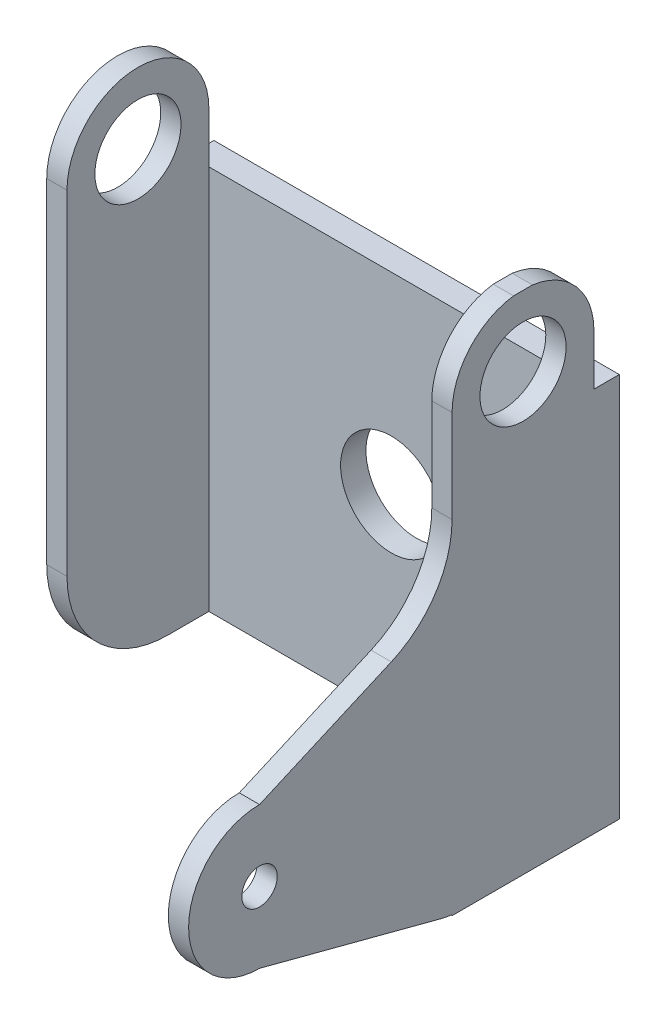
ISO-10303-21;
HEADER;
FILE_DESCRIPTION(('STEP AP214'),'2;1');
FILE_NAME('part.step','',(''),(''),'','','');
FILE_SCHEMA(('AUTOMOTIVE_DESIGN { 1 0 10303 214 1 1 1 1 }'));
ENDSEC;
DATA;
#1=APPLICATION_CONTEXT('core data for automotive mechanical design processes');
#2=APPLICATION_PROTOCOL_DEFINITION('international standard','automotive_design',2000,#1);
#3=PRODUCT_CONTEXT('',#1,'mechanical');
#4=PRODUCT('Part','Part','',(#3));
#5=PRODUCT_RELATED_PRODUCT_CATEGORY('part','',(#4));
#6=PRODUCT_DEFINITION_FORMATION('','',#4);
#7=PRODUCT_DEFINITION_CONTEXT('part definition',#1,'design');
#8=PRODUCT_DEFINITION('design','',#6,#7);
#9=PRODUCT_DEFINITION_SHAPE('','',#8);
#10=(LENGTH_UNIT() NAMED_UNIT(*) SI_UNIT(.MILLI.,.METRE.));
#11=(NAMED_UNIT(*) PLANE_ANGLE_UNIT() SI_UNIT($,.RADIAN.));
#12=(NAMED_UNIT(*) SI_UNIT($,.STERADIAN.) SOLID_ANGLE_UNIT());
#13=UNCERTAINTY_MEASURE_WITH_UNIT(LENGTH_MEASURE(1.E-05),#10,'distance_accuracy_value','');
#14=(GEOMETRIC_REPRESENTATION_CONTEXT(3) GLOBAL_UNCERTAINTY_ASSIGNED_CONTEXT((#13)) GLOBAL_UNIT_ASSIGNED_CONTEXT((#10,
#11,#12)) REPRESENTATION_CONTEXT('',''));
#15=CARTESIAN_POINT('',(0.,0.,0.));
#16=DIRECTION('',(0.,0.,1.));
#17=DIRECTION('',(1.,0.,0.));
#18=AXIS2_PLACEMENT_3D('',#15,#16,#17);
#19=CARTESIAN_POINT('',(20.,-19.,2.5));
#20=DIRECTION('',(-1.,0.,0.));
#21=DIRECTION('',(0.,0.,1.));
#22=AXIS2_PLACEMENT_3D('',#19,#20,#21);
#23=PLANE('',#22);
#24=CARTESIAN_POINT('',(20.,24.,9.5));
#25=DIRECTION('',(1.,0.,0.));
#26=DIRECTION('',(0.,0.,-1.));
#27=AXIS2_PLACEMENT_3D('',#24,#25,#26);
#28=CIRCLE('',#27,4.25);
#29=CARTESIAN_POINT('',(20.,24.,5.25));
#30=VERTEX_POINT('',#29);
#31=EDGE_CURVE('E522',#30,#30,#28,.T.);
#32=ORIENTED_EDGE('',*,*,#31,.F.);
#33=EDGE_LOOP('',(#32));
#34=FACE_BOUND('',#33,.T.);
#35=CARTESIAN_POINT('',(20.,-7.00000000000001,35.5));
#36=DIRECTION('',(1.,0.,0.));
#37=DIRECTION('',(0.,0.,-1.));
#38=AXIS2_PLACEMENT_3D('',#35,#36,#37);
#39=CIRCLE('',#38,1.75);
#40=CARTESIAN_POINT('',(20.,-7.00000000000001,33.75));
#41=VERTEX_POINT('',#40);
#42=EDGE_CURVE('E528',#41,#41,#39,.T.);
#43=ORIENTED_EDGE('',*,*,#42,.F.);
#44=EDGE_LOOP('',(#43));
#45=FACE_BOUND('',#44,.T.);
#46=CARTESIAN_POINT('',(20.,24.,9.5));
#47=DIRECTION('',(1.,0.,0.));
#48=DIRECTION('',(0.,0.,-1.));
#49=AXIS2_PLACEMENT_3D('',#46,#47,#48);
#50=CIRCLE('',#49,7.);
#51=CARTESIAN_POINT('',(20.,24.,2.5));
#52=VERTEX_POINT('',#51);
#53=CARTESIAN_POINT('',(20.,30.9374608885954,8.56638529402736));
#54=VERTEX_POINT('',#53);
#55=EDGE_CURVE('E161',#52,#54,#50,.T.);
#56=ORIENTED_EDGE('',*,*,#55,.T.);
#57=DIRECTION('',(0.,0.,-1.));
#58=VECTOR('',#57,1.);
#59=CARTESIAN_POINT('',(20.,30.9374608885954,42.5));
#60=LINE('',#59,#58);
#61=CARTESIAN_POINT('',(20.,30.9374608885954,10.4336147059726));
#62=VERTEX_POINT('',#61);
#63=EDGE_CURVE('E375',#62,#54,#60,.T.);
#64=ORIENTED_EDGE('',*,*,#63,.F.);
#65=CARTESIAN_POINT('',(20.,24.,9.5));
#66=DIRECTION('',(1.,0.,0.));
#67=DIRECTION('',(0.,0.,-1.));
#68=AXIS2_PLACEMENT_3D('',#65,#66,#67);
#69=CIRCLE('',#68,7.);
#70=CARTESIAN_POINT('',(20.,24.,16.5));
#71=VERTEX_POINT('',#70);
#72=EDGE_CURVE('E294',#62,#71,#69,.T.);
#73=ORIENTED_EDGE('',*,*,#72,.T.);
#74=DIRECTION('',(0.,-1.,0.));
#75=VECTOR('',#74,1.);
#76=CARTESIAN_POINT('',(20.,0.,16.5));
#77=LINE('',#76,#75);
#78=CARTESIAN_POINT('',(20.,14.8521224388592,16.5));
#79=VERTEX_POINT('',#78);
#80=EDGE_CURVE('E346',#71,#79,#77,.T.);
#81=ORIENTED_EDGE('',*,*,#80,.T.);
#82=CARTESIAN_POINT('',(20.,14.8521224388592,26.5));
#83=DIRECTION('',(1.,0.,0.));
#84=DIRECTION('',(0.,0.,-1.));
#85=AXIS2_PLACEMENT_3D('',#82,#83,#84);
#86=CIRCLE('',#85,10.);
#87=CARTESIAN_POINT('',(20.,5.69041116417988,22.4921269332208));
#88=VERTEX_POINT('',#87);
#89=EDGE_CURVE('E344',#79,#88,#86,.F.);
#90=ORIENTED_EDGE('',*,*,#89,.T.);
#91=DIRECTION('',(0.,0.400787306677926,-0.916171127467928));
#92=VECTOR('',#91,1.);
#93=CARTESIAN_POINT('',(20.,13.0352364315052,5.70238151439217));
#94=LINE('',#93,#92);
#95=CARTESIAN_POINT('',(20.,0.,35.5));
#96=VERTEX_POINT('',#95);
#97=EDGE_CURVE('E292',#96,#88,#94,.T.);
#98=ORIENTED_EDGE('',*,*,#97,.F.);
#99=CARTESIAN_POINT('',(20.,-7.00000000000001,35.5));
#100=DIRECTION('',(1.,0.,0.));
#101=DIRECTION('',(0.,0.,-1.));
#102=AXIS2_PLACEMENT_3D('',#99,#100,#101);
#103=CIRCLE('',#102,7.);
#104=CARTESIAN_POINT('',(20.,-14.,35.5));
#105=VERTEX_POINT('',#104);
#106=EDGE_CURVE('E285',#96,#105,#103,.T.);
#107=ORIENTED_EDGE('',*,*,#106,.T.);
#108=DIRECTION('',(0.,-0.254493299279644,-0.967074537262646));
#109=VECTOR('',#108,1.);
#110=CARTESIAN_POINT('',(20.,-21.830310880829,5.74481865284974));
#111=LINE('',#110,#109);
#112=CARTESIAN_POINT('',(20.,-18.6707453726265,17.7511675840195));
#113=VERTEX_POINT('',#112);
#114=EDGE_CURVE('E289',#105,#113,#111,.T.);
#115=ORIENTED_EDGE('',*,*,#114,.T.);
#116=CARTESIAN_POINT('',(20.,-9.,15.206234591223));
#117=DIRECTION('',(1.,0.,0.));
#118=DIRECTION('',(0.,0.,-1.));
#119=AXIS2_PLACEMENT_3D('',#116,#117,#118);
#120=CIRCLE('',#119,10.);
#121=CARTESIAN_POINT('',(20.,-18.9159553784319,16.5));
#122=VERTEX_POINT('',#121);
#123=EDGE_CURVE('E309',#122,#113,#120,.F.);
#124=ORIENTED_EDGE('',*,*,#123,.F.);
#125=DIRECTION('',(0.,-1.,0.));
#126=VECTOR('',#125,1.);
#127=CARTESIAN_POINT('',(20.,0.,16.5));
#128=LINE('',#127,#126);
#129=CARTESIAN_POINT('',(20.,-19.,16.5));
#130=VERTEX_POINT('',#129);
#131=EDGE_CURVE('E312',#122,#130,#128,.T.);
#132=ORIENTED_EDGE('',*,*,#131,.T.);
#133=DIRECTION('',(0.,0.,-1.));
#134=VECTOR('',#133,1.);
#135=CARTESIAN_POINT('',(20.,-19.,2.5));
#136=LINE('',#135,#134);
#137=CARTESIAN_POINT('',(20.,-19.,0.));
#138=VERTEX_POINT('',#137);
#139=EDGE_CURVE('E428',#130,#138,#136,.T.);
#140=ORIENTED_EDGE('',*,*,#139,.T.);
#141=DIRECTION('',(0.,1.,0.));
#142=VECTOR('',#141,1.);
#143=CARTESIAN_POINT('',(20.,-19.,0.));
#144=LINE('',#143,#142);
#145=CARTESIAN_POINT('',(20.,19.,0.));
#146=VERTEX_POINT('',#145);
#147=EDGE_CURVE('E418',#138,#146,#144,.T.);
#148=ORIENTED_EDGE('',*,*,#147,.T.);
#149=DIRECTION('',(0.,0.,-1.));
#150=VECTOR('',#149,1.);
#151=CARTESIAN_POINT('',(20.,19.,2.5));
#152=LINE('',#151,#150);
#153=CARTESIAN_POINT('',(20.,19.,2.5));
#154=VERTEX_POINT('',#153);
#155=EDGE_CURVE('E148',#154,#146,#152,.T.);
#156=ORIENTED_EDGE('',*,*,#155,.F.);
#157=DIRECTION('',(0.,-1.,0.));
#158=VECTOR('',#157,1.);
#159=CARTESIAN_POINT('',(20.,0.,2.5));
#160=LINE('',#159,#158);
#161=EDGE_CURVE('E366',#52,#154,#160,.T.);
#162=ORIENTED_EDGE('',*,*,#161,.F.);
#163=EDGE_LOOP('',(#56,#64,#73,#81,#90,#98,#107,#115,#124,#132,#140,#148,#156,#162));
#164=FACE_BOUND('',#163,.T.);
#165=ADVANCED_FACE('F145',(#34,#45,#164),#23,.F.);
#166=CARTESIAN_POINT('',(0.,30.9374608885954,42.5));
#167=DIRECTION('',(0.,1.,0.));
#168=DIRECTION('',(0.,0.,1.));
#169=AXIS2_PLACEMENT_3D('',#166,#167,#168);
#170=PLANE('',#169);
#171=ORIENTED_EDGE('',*,*,#63,.T.);
#172=DIRECTION('',(1.,0.,0.));
#173=VECTOR('',#172,1.);
#174=CARTESIAN_POINT('',(-20.001,30.9374608885954,8.56638529402736));
#175=LINE('',#174,#173);
#176=CARTESIAN_POINT('',(18.,30.9374608885954,8.56638529402736));
#177=VERTEX_POINT('',#176);
#178=EDGE_CURVE('E330',#177,#54,#175,.T.);
#179=ORIENTED_EDGE('',*,*,#178,.F.);
#180=DIRECTION('',(0.,0.,-1.));
#181=VECTOR('',#180,1.);
#182=CARTESIAN_POINT('',(18.,30.9374608885954,42.5));
#183=LINE('',#182,#181);
#184=CARTESIAN_POINT('',(18.,30.9374608885954,10.4336147059726));
#185=VERTEX_POINT('',#184);
#186=EDGE_CURVE('E372',#185,#177,#183,.T.);
#187=ORIENTED_EDGE('',*,*,#186,.F.);
#188=DIRECTION('',(1.,0.,0.));
#189=VECTOR('',#188,1.);
#190=CARTESIAN_POINT('',(-20.001,30.9374608885954,10.4336147059726));
#191=LINE('',#190,#189);
#192=EDGE_CURVE('E358',#185,#62,#191,.T.);
#193=ORIENTED_EDGE('',*,*,#192,.T.);
#194=EDGE_LOOP('',(#171,#179,#187,#193));
#195=FACE_BOUND('',#194,.T.);
#196=ADVANCED_FACE('F501',(#195),#170,.T.);
#197=CARTESIAN_POINT('',(18.,0.,42.5));
#198=DIRECTION('',(-1.,0.,0.));
#199=DIRECTION('',(0.,0.,1.));
#200=AXIS2_PLACEMENT_3D('',#197,#198,#199);
#201=PLANE('',#200);
#202=CARTESIAN_POINT('',(18.,24.,9.5));
#203=DIRECTION('',(-1.,0.,0.));
#204=DIRECTION('',(0.,0.,1.));
#205=AXIS2_PLACEMENT_3D('',#202,#203,#204);
#206=CIRCLE('',#205,4.25);
#207=CARTESIAN_POINT('',(18.,24.,13.75));
#208=VERTEX_POINT('',#207);
#209=EDGE_CURVE('E525',#208,#208,#206,.F.);
#210=ORIENTED_EDGE('',*,*,#209,.T.);
#211=EDGE_LOOP('',(#210));
#212=FACE_BOUND('',#211,.T.);
#213=CARTESIAN_POINT('',(18.,-7.00000000000001,35.5));
#214=DIRECTION('',(-1.,0.,0.));
#215=DIRECTION('',(0.,0.,1.));
#216=AXIS2_PLACEMENT_3D('',#213,#214,#215);
#217=CIRCLE('',#216,1.75);
#218=CARTESIAN_POINT('',(18.,-7.00000000000001,37.25));
#219=VERTEX_POINT('',#218);
#220=EDGE_CURVE('E332',#219,#219,#217,.F.);
#221=ORIENTED_EDGE('',*,*,#220,.T.);
#222=EDGE_LOOP('',(#221));
#223=FACE_BOUND('',#222,.T.);
#224=ORIENTED_EDGE('',*,*,#186,.T.);
#225=CARTESIAN_POINT('',(18.,24.,9.5));
#226=DIRECTION('',(-1.,0.,0.));
#227=DIRECTION('',(0.,0.,1.));
#228=AXIS2_PLACEMENT_3D('',#225,#226,#227);
#229=CIRCLE('',#228,7.);
#230=CARTESIAN_POINT('',(18.,24.,2.5));
#231=VERTEX_POINT('',#230);
#232=EDGE_CURVE('E304',#231,#177,#229,.F.);
#233=ORIENTED_EDGE('',*,*,#232,.F.);
#234=DIRECTION('',(0.,1.,0.));
#235=VECTOR('',#234,1.);
#236=CARTESIAN_POINT('',(18.,0.,2.5));
#237=LINE('',#236,#235);
#238=CARTESIAN_POINT('',(18.,19.,2.5));
#239=VERTEX_POINT('',#238);
#240=EDGE_CURVE('E368',#239,#231,#237,.T.);
#241=ORIENTED_EDGE('',*,*,#240,.F.);
#242=CARTESIAN_POINT('',(18.,-19.,2.5));
#243=VERTEX_POINT('',#242);
#244=EDGE_CURVE('E169',#243,#239,#237,.T.);
#245=ORIENTED_EDGE('',*,*,#244,.F.);
#246=DIRECTION('',(0.,0.,-1.));
#247=VECTOR('',#246,1.);
#248=CARTESIAN_POINT('',(18.,-19.,42.5));
#249=LINE('',#248,#247);
#250=CARTESIAN_POINT('',(18.,-19.,16.5));
#251=VERTEX_POINT('',#250);
#252=EDGE_CURVE('E370',#251,#243,#249,.T.);
#253=ORIENTED_EDGE('',*,*,#252,.F.);
#254=DIRECTION('',(0.,-1.,0.));
#255=VECTOR('',#254,1.);
#256=CARTESIAN_POINT('',(18.,0.,16.5));
#257=LINE('',#256,#255);
#258=CARTESIAN_POINT('',(18.,-18.9159553784319,16.5));
#259=VERTEX_POINT('',#258);
#260=EDGE_CURVE('E325',#259,#251,#257,.T.);
#261=ORIENTED_EDGE('',*,*,#260,.F.);
#262=CARTESIAN_POINT('',(18.,-9.,15.206234591223));
#263=DIRECTION('',(-1.,0.,0.));
#264=DIRECTION('',(0.,0.,1.));
#265=AXIS2_PLACEMENT_3D('',#262,#263,#264);
#266=CIRCLE('',#265,10.);
#267=CARTESIAN_POINT('',(18.,-18.6707453726265,17.7511675840195));
#268=VERTEX_POINT('',#267);
#269=EDGE_CURVE('E322',#259,#268,#266,.T.);
#270=ORIENTED_EDGE('',*,*,#269,.T.);
#271=DIRECTION('',(0.,-0.254493299279644,-0.967074537262646));
#272=VECTOR('',#271,1.);
#273=CARTESIAN_POINT('',(18.,-21.830310880829,5.74481865284974));
#274=LINE('',#273,#272);
#275=CARTESIAN_POINT('',(18.,-14.,35.5));
#276=VERTEX_POINT('',#275);
#277=EDGE_CURVE('E320',#276,#268,#274,.T.);
#278=ORIENTED_EDGE('',*,*,#277,.F.);
#279=CARTESIAN_POINT('',(18.,-7.00000000000001,35.5));
#280=DIRECTION('',(-1.,0.,0.));
#281=DIRECTION('',(0.,0.,1.));
#282=AXIS2_PLACEMENT_3D('',#279,#280,#281);
#283=CIRCLE('',#282,7.);
#284=CARTESIAN_POINT('',(18.,0.,35.5));
#285=VERTEX_POINT('',#284);
#286=EDGE_CURVE('E300',#285,#276,#283,.F.);
#287=ORIENTED_EDGE('',*,*,#286,.F.);
#288=DIRECTION('',(0.,0.400787306677926,-0.916171127467928));
#289=VECTOR('',#288,1.);
#290=CARTESIAN_POINT('',(18.,13.0352364315052,5.70238151439217));
#291=LINE('',#290,#289);
#292=CARTESIAN_POINT('',(18.,5.69041116417988,22.4921269332208));
#293=VERTEX_POINT('',#292);
#294=EDGE_CURVE('E340',#285,#293,#291,.T.);
#295=ORIENTED_EDGE('',*,*,#294,.T.);
#296=CARTESIAN_POINT('',(18.,14.8521224388592,26.5));
#297=DIRECTION('',(-1.,0.,0.));
#298=DIRECTION('',(0.,0.,1.));
#299=AXIS2_PLACEMENT_3D('',#296,#297,#298);
#300=CIRCLE('',#299,10.);
#301=CARTESIAN_POINT('',(18.,14.8521224388592,16.5));
#302=VERTEX_POINT('',#301);
#303=EDGE_CURVE('E337',#302,#293,#300,.T.);
#304=ORIENTED_EDGE('',*,*,#303,.F.);
#305=DIRECTION('',(0.,-1.,0.));
#306=VECTOR('',#305,1.);
#307=CARTESIAN_POINT('',(18.,0.,16.5));
#308=LINE('',#307,#306);
#309=CARTESIAN_POINT('',(18.,24.,16.5));
#310=VERTEX_POINT('',#309);
#311=EDGE_CURVE('E355',#310,#302,#308,.T.);
#312=ORIENTED_EDGE('',*,*,#311,.F.);
#313=CARTESIAN_POINT('',(18.,24.,9.5));
#314=DIRECTION('',(-1.,0.,0.));
#315=DIRECTION('',(0.,0.,1.));
#316=AXIS2_PLACEMENT_3D('',#313,#314,#315);
#317=CIRCLE('',#316,7.);
#318=EDGE_CURVE('E327',#185,#310,#317,.F.);
#319=ORIENTED_EDGE('',*,*,#318,.F.);
#320=EDGE_LOOP('',(#224,#233,#241,#245,#253,#261,#270,#278,#287,#295,#304,#312,#319));
#321=FACE_BOUND('',#320,.T.);
#322=ADVANCED_FACE('F494',(#212,#223,#321),#201,.T.);
#323=CARTESIAN_POINT('',(-20.,-19.,2.5));
#324=DIRECTION('',(0.,1.,0.));
#325=DIRECTION('',(0.,0.,1.));
#326=AXIS2_PLACEMENT_3D('',#323,#324,#325);
#327=PLANE('',#326);
#328=DIRECTION('',(1.,0.,0.));
#329=VECTOR('',#328,1.);
#330=CARTESIAN_POINT('',(-20.001,-19.,16.5));
#331=LINE('',#330,#329);
#332=EDGE_CURVE('E310',#251,#130,#331,.T.);
#333=ORIENTED_EDGE('',*,*,#332,.F.);
#334=ORIENTED_EDGE('',*,*,#252,.T.);
#335=DIRECTION('',(1.,0.,0.));
#336=VECTOR('',#335,1.);
#337=CARTESIAN_POINT('',(-20.,-19.,2.5));
#338=LINE('',#337,#336);
#339=CARTESIAN_POINT('',(-18.,-19.,2.5));
#340=VERTEX_POINT('',#339);
#341=EDGE_CURVE('E424',#340,#243,#338,.T.);
#342=ORIENTED_EDGE('',*,*,#341,.F.);
#343=DIRECTION('',(0.,0.,-1.));
#344=VECTOR('',#343,1.);
#345=CARTESIAN_POINT('',(-18.,-19.,16.5));
#346=LINE('',#345,#344);
#347=CARTESIAN_POINT('',(-18.,-19.,6.49999999999993));
#348=VERTEX_POINT('',#347);
#349=EDGE_CURVE('E410',#348,#340,#346,.T.);
#350=ORIENTED_EDGE('',*,*,#349,.F.);
#351=DIRECTION('',(1.,0.,0.));
#352=VECTOR('',#351,1.);
#353=CARTESIAN_POINT('',(-20.,-19.,6.49999999999993));
#354=LINE('',#353,#352);
#355=CARTESIAN_POINT('',(-20.,-19.,6.49999999999993));
#356=VERTEX_POINT('',#355);
#357=EDGE_CURVE('E391',#356,#348,#354,.T.);
#358=ORIENTED_EDGE('',*,*,#357,.F.);
#359=DIRECTION('',(0.,0.,-1.));
#360=VECTOR('',#359,1.);
#361=CARTESIAN_POINT('',(-20.,-19.,2.5));
#362=LINE('',#361,#360);
#363=CARTESIAN_POINT('',(-20.,-19.,0.));
#364=VERTEX_POINT('',#363);
#365=EDGE_CURVE('E440',#356,#364,#362,.T.);
#366=ORIENTED_EDGE('',*,*,#365,.T.);
#367=DIRECTION('',(1.,0.,0.));
#368=VECTOR('',#367,1.);
#369=CARTESIAN_POINT('',(-20.,-19.,0.));
#370=LINE('',#369,#368);
#371=EDGE_CURVE('E436',#364,#138,#370,.T.);
#372=ORIENTED_EDGE('',*,*,#371,.T.);
#373=ORIENTED_EDGE('',*,*,#139,.F.);
#374=EDGE_LOOP('',(#333,#334,#342,#350,#358,#366,#372,#373));
#375=FACE_BOUND('',#374,.T.);
#376=ADVANCED_FACE('F464',(#375),#327,.F.);
#377=CARTESIAN_POINT('',(-20.,-19.,2.5));
#378=DIRECTION('',(1.,0.,0.));
#379=DIRECTION('',(0.,0.,-1.));
#380=AXIS2_PLACEMENT_3D('',#377,#378,#379);
#381=PLANE('',#380);
#382=CARTESIAN_POINT('',(-20.,24.,9.5));
#383=DIRECTION('',(1.,0.,0.));
#384=DIRECTION('',(0.,1.,0.));
#385=AXIS2_PLACEMENT_3D('',#382,#383,#384);
#386=CIRCLE('',#385,4.25);
#387=CARTESIAN_POINT('',(-20.,28.25,9.5));
#388=VERTEX_POINT('',#387);
#389=EDGE_CURVE('E381',#388,#388,#386,.T.);
#390=ORIENTED_EDGE('',*,*,#389,.T.);
#391=EDGE_LOOP('',(#390));
#392=FACE_BOUND('',#391,.T.);
#393=DIRECTION('',(0.,-1.,0.));
#394=VECTOR('',#393,1.);
#395=CARTESIAN_POINT('',(-20.,31.,16.5));
#396=LINE('',#395,#394);
#397=CARTESIAN_POINT('',(-20.,24.,16.5));
#398=VERTEX_POINT('',#397);
#399=CARTESIAN_POINT('',(-20.,-8.99999999999993,16.5));
#400=VERTEX_POINT('',#399);
#401=EDGE_CURVE('E408',#398,#400,#396,.T.);
#402=ORIENTED_EDGE('',*,*,#401,.F.);
#403=CARTESIAN_POINT('',(-20.,24.,9.5));
#404=DIRECTION('',(1.,0.,0.));
#405=DIRECTION('',(0.,1.,0.));
#406=AXIS2_PLACEMENT_3D('',#403,#404,#405);
#407=CIRCLE('',#406,7.);
#408=CARTESIAN_POINT('',(-20.,24.,2.5));
#409=VERTEX_POINT('',#408);
#410=EDGE_CURVE('E402',#409,#398,#407,.T.);
#411=ORIENTED_EDGE('',*,*,#410,.F.);
#412=DIRECTION('',(0.,-1.,0.));
#413=VECTOR('',#412,1.);
#414=CARTESIAN_POINT('',(-20.,19.,2.5));
#415=LINE('',#414,#413);
#416=CARTESIAN_POINT('',(-20.,19.,2.5));
#417=VERTEX_POINT('',#416);
#418=EDGE_CURVE('E398',#409,#417,#415,.T.);
#419=ORIENTED_EDGE('',*,*,#418,.T.);
#420=DIRECTION('',(0.,0.,-1.));
#421=VECTOR('',#420,1.);
#422=CARTESIAN_POINT('',(-20.,19.,2.5));
#423=LINE('',#422,#421);
#424=CARTESIAN_POINT('',(-20.,19.,0.));
#425=VERTEX_POINT('',#424);
#426=EDGE_CURVE('E441',#417,#425,#423,.T.);
#427=ORIENTED_EDGE('',*,*,#426,.T.);
#428=DIRECTION('',(0.,-1.,0.));
#429=VECTOR('',#428,1.);
#430=CARTESIAN_POINT('',(-20.,-19.,0.));
#431=LINE('',#430,#429);
#432=EDGE_CURVE('E433',#425,#364,#431,.T.);
#433=ORIENTED_EDGE('',*,*,#432,.T.);
#434=ORIENTED_EDGE('',*,*,#365,.F.);
#435=CARTESIAN_POINT('',(-20.,-9.,6.5));
#436=DIRECTION('',(1.,0.,0.));
#437=DIRECTION('',(0.,1.,0.));
#438=AXIS2_PLACEMENT_3D('',#435,#436,#437);
#439=CIRCLE('',#438,10.);
#440=EDGE_CURVE('E388',#356,#400,#439,.F.);
#441=ORIENTED_EDGE('',*,*,#440,.T.);
#442=EDGE_LOOP('',(#402,#411,#419,#427,#433,#434,#441));
#443=FACE_BOUND('',#442,.T.);
#444=ADVANCED_FACE('F460',(#392,#443),#381,.F.);
#445=CARTESIAN_POINT('',(-18.,19.,16.5));
#446=DIRECTION('',(1.,0.,0.));
#447=DIRECTION('',(0.,1.,0.));
#448=AXIS2_PLACEMENT_3D('',#445,#446,#447);
#449=PLANE('',#448);
#450=CARTESIAN_POINT('',(-18.,24.,9.5));
#451=DIRECTION('',(1.,0.,0.));
#452=DIRECTION('',(0.,1.,0.));
#453=AXIS2_PLACEMENT_3D('',#450,#451,#452);
#454=CIRCLE('',#453,4.25);
#455=CARTESIAN_POINT('',(-18.,28.25,9.5));
#456=VERTEX_POINT('',#455);
#457=EDGE_CURVE('E382',#456,#456,#454,.T.);
#458=ORIENTED_EDGE('',*,*,#457,.F.);
#459=EDGE_LOOP('',(#458));
#460=FACE_BOUND('',#459,.T.);
#461=CARTESIAN_POINT('',(-18.,24.,9.5));
#462=DIRECTION('',(1.,0.,0.));
#463=DIRECTION('',(0.,1.,0.));
#464=AXIS2_PLACEMENT_3D('',#461,#462,#463);
#465=CIRCLE('',#464,7.);
#466=CARTESIAN_POINT('',(-18.,24.,2.5));
#467=VERTEX_POINT('',#466);
#468=CARTESIAN_POINT('',(-18.,24.,16.5));
#469=VERTEX_POINT('',#468);
#470=EDGE_CURVE('E394',#467,#469,#465,.T.);
#471=ORIENTED_EDGE('',*,*,#470,.T.);
#472=DIRECTION('',(0.,1.,0.));
#473=VECTOR('',#472,1.);
#474=CARTESIAN_POINT('',(-18.,19.,16.5));
#475=LINE('',#474,#473);
#476=CARTESIAN_POINT('',(-18.,-8.99999999999993,16.5));
#477=VERTEX_POINT('',#476);
#478=EDGE_CURVE('E405',#477,#469,#475,.T.);
#479=ORIENTED_EDGE('',*,*,#478,.F.);
#480=CARTESIAN_POINT('',(-18.,-9.,6.5));
#481=DIRECTION('',(1.,0.,0.));
#482=DIRECTION('',(0.,1.,0.));
#483=AXIS2_PLACEMENT_3D('',#480,#481,#482);
#484=CIRCLE('',#483,10.);
#485=EDGE_CURVE('E392',#348,#477,#484,.F.);
#486=ORIENTED_EDGE('',*,*,#485,.F.);
#487=ORIENTED_EDGE('',*,*,#349,.T.);
#488=DIRECTION('',(0.,-1.,0.));
#489=VECTOR('',#488,1.);
#490=CARTESIAN_POINT('',(-18.,19.,2.5));
#491=LINE('',#490,#489);
#492=CARTESIAN_POINT('',(-18.,19.,2.5));
#493=VERTEX_POINT('',#492);
#494=EDGE_CURVE('E12',#493,#340,#491,.T.);
#495=ORIENTED_EDGE('',*,*,#494,.F.);
#496=EDGE_CURVE('E154',#467,#493,#491,.T.);
#497=ORIENTED_EDGE('',*,*,#496,.F.);
#498=EDGE_LOOP('',(#471,#479,#486,#487,#495,#497));
#499=FACE_BOUND('',#498,.T.);
#500=ADVANCED_FACE('F473',(#460,#499),#449,.T.);
#501=CARTESIAN_POINT('',(0.,0.,2.5));
#502=DIRECTION('',(0.,0.,-1.));
#503=DIRECTION('',(-1.,0.,0.));
#504=AXIS2_PLACEMENT_3D('',#501,#502,#503);
#505=PLANE('',#504);
#506=ORIENTED_EDGE('',*,*,#341,.T.);
#507=ORIENTED_EDGE('',*,*,#244,.T.);
#508=DIRECTION('',(-1.,0.,0.));
#509=VECTOR('',#508,1.);
#510=CARTESIAN_POINT('',(-20.,19.,2.5));
#511=LINE('',#510,#509);
#512=EDGE_CURVE('E425',#239,#493,#511,.T.);
#513=ORIENTED_EDGE('',*,*,#512,.T.);
#514=ORIENTED_EDGE('',*,*,#494,.T.);
#515=EDGE_LOOP('',(#506,#507,#513,#514));
#516=FACE_BOUND('',#515,.T.);
#517=CARTESIAN_POINT('',(0.,0.,2.5));
#518=DIRECTION('',(0.,0.,1.));
#519=DIRECTION('',(1.,0.,0.));
#520=AXIS2_PLACEMENT_3D('',#517,#518,#519);
#521=CIRCLE('',#520,5.);
#522=CARTESIAN_POINT('',(5.,0.,2.5));
#523=VERTEX_POINT('',#522);
#524=EDGE_CURVE('E415',#523,#523,#521,.T.);
#525=ORIENTED_EDGE('',*,*,#524,.F.);
#526=EDGE_LOOP('',(#525));
#527=FACE_BOUND('',#526,.T.);
#528=ADVANCED_FACE('F486',(#516,#527),#505,.F.);
#529=CARTESIAN_POINT('',(0.,0.,0.));
#530=DIRECTION('',(0.,0.,-1.));
#531=DIRECTION('',(-1.,0.,0.));
#532=AXIS2_PLACEMENT_3D('',#529,#530,#531);
#533=PLANE('',#532);
#534=ORIENTED_EDGE('',*,*,#147,.F.);
#535=ORIENTED_EDGE('',*,*,#371,.F.);
#536=ORIENTED_EDGE('',*,*,#432,.F.);
#537=DIRECTION('',(-1.,0.,0.));
#538=VECTOR('',#537,1.);
#539=CARTESIAN_POINT('',(-20.,19.,0.));
#540=LINE('',#539,#538);
#541=EDGE_CURVE('E431',#146,#425,#540,.T.);
#542=ORIENTED_EDGE('',*,*,#541,.F.);
#543=EDGE_LOOP('',(#534,#535,#536,#542));
#544=FACE_BOUND('',#543,.T.);
#545=CARTESIAN_POINT('',(0.,0.,0.));
#546=DIRECTION('',(0.,0.,1.));
#547=DIRECTION('',(1.,0.,0.));
#548=AXIS2_PLACEMENT_3D('',#545,#546,#547);
#549=CIRCLE('',#548,5.);
#550=CARTESIAN_POINT('',(5.,0.,0.));
#551=VERTEX_POINT('',#550);
#552=EDGE_CURVE('E414',#551,#551,#549,.T.);
#553=ORIENTED_EDGE('',*,*,#552,.T.);
#554=EDGE_LOOP('',(#553));
#555=FACE_BOUND('',#554,.T.);
#556=ADVANCED_FACE('F456',(#544,#555),#533,.T.);
#557=CARTESIAN_POINT('',(-20.,19.,2.5));
#558=DIRECTION('',(0.,-1.,0.));
#559=DIRECTION('',(0.,0.,-1.));
#560=AXIS2_PLACEMENT_3D('',#557,#558,#559);
#561=PLANE('',#560);
#562=ORIENTED_EDGE('',*,*,#541,.T.);
#563=ORIENTED_EDGE('',*,*,#426,.F.);
#564=EDGE_CURVE('E426',#493,#417,#511,.T.);
#565=ORIENTED_EDGE('',*,*,#564,.F.);
#566=ORIENTED_EDGE('',*,*,#512,.F.);
#567=EDGE_CURVE('E421',#154,#239,#511,.T.);
#568=ORIENTED_EDGE('',*,*,#567,.F.);
#569=ORIENTED_EDGE('',*,*,#155,.T.);
#570=EDGE_LOOP('',(#562,#563,#565,#566,#568,#569));
#571=FACE_BOUND('',#570,.T.);
#572=ADVANCED_FACE('F450',(#571),#561,.F.);
#573=CARTESIAN_POINT('',(0.,0.,2.5));
#574=DIRECTION('',(0.,0.,-1.));
#575=DIRECTION('',(-1.,0.,0.));
#576=AXIS2_PLACEMENT_3D('',#573,#574,#575);
#577=CYLINDRICAL_SURFACE('',#576,5.);
#578=ORIENTED_EDGE('',*,*,#524,.T.);
#579=EDGE_LOOP('',(#578));
#580=FACE_BOUND('',#579,.T.);
#581=ORIENTED_EDGE('',*,*,#552,.F.);
#582=EDGE_LOOP('',(#581));
#583=FACE_BOUND('',#582,.T.);
#584=ADVANCED_FACE('F595',(#580,#583),#577,.F.);
#585=CARTESIAN_POINT('',(0.,0.,2.5));
#586=DIRECTION('',(0.,0.,1.));
#587=DIRECTION('',(1.,0.,0.));
#588=AXIS2_PLACEMENT_3D('',#585,#586,#587);
#589=PLANE('',#588);
#590=ORIENTED_EDGE('',*,*,#418,.F.);
#591=DIRECTION('',(1.,0.,0.));
#592=VECTOR('',#591,1.);
#593=CARTESIAN_POINT('',(-20.,24.,2.5));
#594=LINE('',#593,#592);
#595=EDGE_CURVE('E385',#409,#467,#594,.T.);
#596=ORIENTED_EDGE('',*,*,#595,.T.);
#597=ORIENTED_EDGE('',*,*,#496,.T.);
#598=ORIENTED_EDGE('',*,*,#564,.T.);
#599=EDGE_LOOP('',(#590,#596,#597,#598));
#600=FACE_BOUND('',#599,.T.);
#601=ADVANCED_FACE('F484',(#600),#589,.F.);
#602=CARTESIAN_POINT('',(0.,0.,16.5));
#603=DIRECTION('',(0.,0.,1.));
#604=DIRECTION('',(1.,0.,0.));
#605=AXIS2_PLACEMENT_3D('',#602,#603,#604);
#606=PLANE('',#605);
#607=DIRECTION('',(1.,0.,0.));
#608=VECTOR('',#607,1.);
#609=CARTESIAN_POINT('',(-20.,24.,16.5));
#610=LINE('',#609,#608);
#611=EDGE_CURVE('E378',#398,#469,#610,.T.);
#612=ORIENTED_EDGE('',*,*,#611,.F.);
#613=ORIENTED_EDGE('',*,*,#401,.T.);
#614=DIRECTION('',(1.,0.,0.));
#615=VECTOR('',#614,1.);
#616=CARTESIAN_POINT('',(-20.,-8.99999999999993,16.5));
#617=LINE('',#616,#615);
#618=EDGE_CURVE('E395',#400,#477,#617,.T.);
#619=ORIENTED_EDGE('',*,*,#618,.T.);
#620=ORIENTED_EDGE('',*,*,#478,.T.);
#621=EDGE_LOOP('',(#612,#613,#619,#620));
#622=FACE_BOUND('',#621,.T.);
#623=ADVANCED_FACE('F478',(#622),#606,.T.);
#624=CARTESIAN_POINT('',(-20.,-9.,6.5));
#625=DIRECTION('',(1.,0.,0.));
#626=DIRECTION('',(0.,1.,0.));
#627=AXIS2_PLACEMENT_3D('',#624,#625,#626);
#628=CYLINDRICAL_SURFACE('',#627,10.);
#629=ORIENTED_EDGE('',*,*,#485,.T.);
#630=ORIENTED_EDGE('',*,*,#618,.F.);
#631=ORIENTED_EDGE('',*,*,#440,.F.);
#632=ORIENTED_EDGE('',*,*,#357,.T.);
#633=EDGE_LOOP('',(#629,#630,#631,#632));
#634=FACE_BOUND('',#633,.T.);
#635=ADVANCED_FACE('F469',(#634),#628,.T.);
#636=CARTESIAN_POINT('',(-20.,24.,9.5));
#637=DIRECTION('',(1.,0.,0.));
#638=DIRECTION('',(0.,1.,0.));
#639=AXIS2_PLACEMENT_3D('',#636,#637,#638);
#640=CYLINDRICAL_SURFACE('',#639,7.);
#641=ORIENTED_EDGE('',*,*,#470,.F.);
#642=ORIENTED_EDGE('',*,*,#595,.F.);
#643=ORIENTED_EDGE('',*,*,#410,.T.);
#644=ORIENTED_EDGE('',*,*,#611,.T.);
#645=EDGE_LOOP('',(#641,#642,#643,#644));
#646=FACE_BOUND('',#645,.T.);
#647=ADVANCED_FACE('F585',(#646),#640,.T.);
#648=CARTESIAN_POINT('',(-20.,24.,9.5));
#649=DIRECTION('',(1.,0.,0.));
#650=DIRECTION('',(0.,1.,0.));
#651=AXIS2_PLACEMENT_3D('',#648,#649,#650);
#652=CYLINDRICAL_SURFACE('',#651,4.25);
#653=ORIENTED_EDGE('',*,*,#389,.F.);
#654=EDGE_LOOP('',(#653));
#655=FACE_BOUND('',#654,.T.);
#656=ORIENTED_EDGE('',*,*,#457,.T.);
#657=EDGE_LOOP('',(#656));
#658=FACE_BOUND('',#657,.T.);
#659=ADVANCED_FACE('F579',(#655,#658),#652,.F.);
#660=CARTESIAN_POINT('',(0.,0.,2.5));
#661=DIRECTION('',(0.,0.,1.));
#662=DIRECTION('',(1.,0.,0.));
#663=AXIS2_PLACEMENT_3D('',#660,#661,#662);
#664=PLANE('',#663);
#665=ORIENTED_EDGE('',*,*,#240,.T.);
#666=DIRECTION('',(1.,0.,0.));
#667=VECTOR('',#666,1.);
#668=CARTESIAN_POINT('',(-20.001,24.,2.5));
#669=LINE('',#668,#667);
#670=EDGE_CURVE('E328',#231,#52,#669,.T.);
#671=ORIENTED_EDGE('',*,*,#670,.T.);
#672=ORIENTED_EDGE('',*,*,#161,.T.);
#673=ORIENTED_EDGE('',*,*,#567,.T.);
#674=EDGE_LOOP('',(#665,#671,#672,#673));
#675=FACE_BOUND('',#674,.T.);
#676=ADVANCED_FACE('F491',(#675),#664,.F.);
#677=CARTESIAN_POINT('',(-20.001,14.8521224388592,26.5));
#678=DIRECTION('',(1.,0.,0.));
#679=DIRECTION('',(0.,0.,-1.));
#680=AXIS2_PLACEMENT_3D('',#677,#678,#679);
#681=CYLINDRICAL_SURFACE('',#680,10.);
#682=ORIENTED_EDGE('',*,*,#303,.T.);
#683=DIRECTION('',(1.,0.,0.));
#684=VECTOR('',#683,1.);
#685=CARTESIAN_POINT('',(-20.001,5.69041116417988,22.4921269332208));
#686=LINE('',#685,#684);
#687=EDGE_CURVE('E353',#293,#88,#686,.T.);
#688=ORIENTED_EDGE('',*,*,#687,.T.);
#689=ORIENTED_EDGE('',*,*,#89,.F.);
#690=DIRECTION('',(1.,0.,0.));
#691=VECTOR('',#690,1.);
#692=CARTESIAN_POINT('',(-20.001,14.8521224388592,16.5));
#693=LINE('',#692,#691);
#694=EDGE_CURVE('E352',#302,#79,#693,.T.);
#695=ORIENTED_EDGE('',*,*,#694,.F.);
#696=EDGE_LOOP('',(#682,#688,#689,#695));
#697=FACE_BOUND('',#696,.T.);
#698=ADVANCED_FACE('F512',(#697),#681,.F.);
#699=CARTESIAN_POINT('',(-20.001,13.0352364315052,5.70238151439217));
#700=DIRECTION('',(0.,-0.916171127467928,-0.400787306677926));
#701=DIRECTION('',(0.,0.400787306677926,-0.916171127467928));
#702=AXIS2_PLACEMENT_3D('',#699,#700,#701);
#703=PLANE('',#702);
#704=DIRECTION('',(1.,0.,0.));
#705=VECTOR('',#704,1.);
#706=CARTESIAN_POINT('',(-20.001,0.,35.5));
#707=LINE('',#706,#705);
#708=EDGE_CURVE('E356',#285,#96,#707,.T.);
#709=ORIENTED_EDGE('',*,*,#708,.T.);
#710=ORIENTED_EDGE('',*,*,#97,.T.);
#711=ORIENTED_EDGE('',*,*,#687,.F.);
#712=ORIENTED_EDGE('',*,*,#294,.F.);
#713=EDGE_LOOP('',(#709,#710,#711,#712));
#714=FACE_BOUND('',#713,.T.);
#715=ADVANCED_FACE('F515',(#714),#703,.F.);
#716=CARTESIAN_POINT('',(-20.001,-7.00000000000001,35.5));
#717=DIRECTION('',(1.,0.,0.));
#718=DIRECTION('',(0.,0.,-1.));
#719=AXIS2_PLACEMENT_3D('',#716,#717,#718);
#720=CYLINDRICAL_SURFACE('',#719,7.);
#721=ORIENTED_EDGE('',*,*,#286,.T.);
#722=DIRECTION('',(1.,0.,0.));
#723=VECTOR('',#722,1.);
#724=CARTESIAN_POINT('',(-20.001,-14.,35.5));
#725=LINE('',#724,#723);
#726=EDGE_CURVE('E297',#276,#105,#725,.T.);
#727=ORIENTED_EDGE('',*,*,#726,.T.);
#728=ORIENTED_EDGE('',*,*,#106,.F.);
#729=ORIENTED_EDGE('',*,*,#708,.F.);
#730=EDGE_LOOP('',(#721,#727,#728,#729));
#731=FACE_BOUND('',#730,.T.);
#732=ADVANCED_FACE('F298',(#731),#720,.T.);
#733=CARTESIAN_POINT('',(-20.001,24.,9.5));
#734=DIRECTION('',(1.,0.,0.));
#735=DIRECTION('',(0.,0.,-1.));
#736=AXIS2_PLACEMENT_3D('',#733,#734,#735);
#737=CYLINDRICAL_SURFACE('',#736,7.);
#738=ORIENTED_EDGE('',*,*,#318,.T.);
#739=DIRECTION('',(1.,0.,0.));
#740=VECTOR('',#739,1.);
#741=CARTESIAN_POINT('',(-20.001,24.,16.5));
#742=LINE('',#741,#740);
#743=EDGE_CURVE('E361',#310,#71,#742,.T.);
#744=ORIENTED_EDGE('',*,*,#743,.T.);
#745=ORIENTED_EDGE('',*,*,#72,.F.);
#746=ORIENTED_EDGE('',*,*,#192,.F.);
#747=EDGE_LOOP('',(#738,#744,#745,#746));
#748=FACE_BOUND('',#747,.T.);
#749=ADVANCED_FACE('F505',(#748),#737,.T.);
#750=CARTESIAN_POINT('',(-20.001,0.,16.5));
#751=DIRECTION('',(0.,0.,1.));
#752=DIRECTION('',(1.,0.,0.));
#753=AXIS2_PLACEMENT_3D('',#750,#751,#752);
#754=PLANE('',#753);
#755=ORIENTED_EDGE('',*,*,#311,.T.);
#756=ORIENTED_EDGE('',*,*,#694,.T.);
#757=ORIENTED_EDGE('',*,*,#80,.F.);
#758=ORIENTED_EDGE('',*,*,#743,.F.);
#759=EDGE_LOOP('',(#755,#756,#757,#758));
#760=FACE_BOUND('',#759,.T.);
#761=ADVANCED_FACE('F508',(#760),#754,.T.);
#762=CARTESIAN_POINT('',(-20.001,-21.830310880829,5.74481865284974));
#763=DIRECTION('',(0.,-0.967074537262646,0.254493299279644));
#764=DIRECTION('',(0.,-0.254493299279644,-0.967074537262646));
#765=AXIS2_PLACEMENT_3D('',#762,#763,#764);
#766=PLANE('',#765);
#767=ORIENTED_EDGE('',*,*,#277,.T.);
#768=DIRECTION('',(1.,0.,0.));
#769=VECTOR('',#768,1.);
#770=CARTESIAN_POINT('',(-20.001,-18.6707453726265,17.7511675840195));
#771=LINE('',#770,#769);
#772=EDGE_CURVE('E303',#268,#113,#771,.T.);
#773=ORIENTED_EDGE('',*,*,#772,.T.);
#774=ORIENTED_EDGE('',*,*,#114,.F.);
#775=ORIENTED_EDGE('',*,*,#726,.F.);
#776=EDGE_LOOP('',(#767,#773,#774,#775));
#777=FACE_BOUND('',#776,.T.);
#778=ADVANCED_FACE('F306',(#777),#766,.T.);
#779=CARTESIAN_POINT('',(-20.001,-9.,15.206234591223));
#780=DIRECTION('',(1.,0.,0.));
#781=DIRECTION('',(0.,0.,-1.));
#782=AXIS2_PLACEMENT_3D('',#779,#780,#781);
#783=CYLINDRICAL_SURFACE('',#782,10.);
#784=DIRECTION('',(1.,0.,0.));
#785=VECTOR('',#784,1.);
#786=CARTESIAN_POINT('',(-20.001,-18.9159553784319,16.5));
#787=LINE('',#786,#785);
#788=EDGE_CURVE('E314',#259,#122,#787,.T.);
#789=ORIENTED_EDGE('',*,*,#788,.T.);
#790=ORIENTED_EDGE('',*,*,#123,.T.);
#791=ORIENTED_EDGE('',*,*,#772,.F.);
#792=ORIENTED_EDGE('',*,*,#269,.F.);
#793=EDGE_LOOP('',(#789,#790,#791,#792));
#794=FACE_BOUND('',#793,.T.);
#795=ADVANCED_FACE('F518',(#794),#783,.T.);
#796=CARTESIAN_POINT('',(-20.001,0.,16.5));
#797=DIRECTION('',(0.,0.,1.));
#798=DIRECTION('',(1.,0.,0.));
#799=AXIS2_PLACEMENT_3D('',#796,#797,#798);
#800=PLANE('',#799);
#801=ORIENTED_EDGE('',*,*,#260,.T.);
#802=ORIENTED_EDGE('',*,*,#332,.T.);
#803=ORIENTED_EDGE('',*,*,#131,.F.);
#804=ORIENTED_EDGE('',*,*,#788,.F.);
#805=EDGE_LOOP('',(#801,#802,#803,#804));
#806=FACE_BOUND('',#805,.T.);
#807=ADVANCED_FACE('F557',(#806),#800,.T.);
#808=CARTESIAN_POINT('',(-20.001,24.,9.5));
#809=DIRECTION('',(1.,0.,0.));
#810=DIRECTION('',(0.,0.,-1.));
#811=AXIS2_PLACEMENT_3D('',#808,#809,#810);
#812=CYLINDRICAL_SURFACE('',#811,7.);
#813=ORIENTED_EDGE('',*,*,#232,.T.);
#814=ORIENTED_EDGE('',*,*,#178,.T.);
#815=ORIENTED_EDGE('',*,*,#55,.F.);
#816=ORIENTED_EDGE('',*,*,#670,.F.);
#817=EDGE_LOOP('',(#813,#814,#815,#816));
#818=FACE_BOUND('',#817,.T.);
#819=ADVANCED_FACE('F499',(#818),#812,.T.);
#820=CARTESIAN_POINT('',(-20.001,-7.00000000000001,35.5));
#821=DIRECTION('',(1.,0.,0.));
#822=DIRECTION('',(0.,0.,-1.));
#823=AXIS2_PLACEMENT_3D('',#820,#821,#822);
#824=CYLINDRICAL_SURFACE('',#823,1.75);
#825=ORIENTED_EDGE('',*,*,#220,.F.);
#826=EDGE_LOOP('',(#825));
#827=FACE_BOUND('',#826,.T.);
#828=ORIENTED_EDGE('',*,*,#42,.T.);
#829=EDGE_LOOP('',(#828));
#830=FACE_BOUND('',#829,.T.);
#831=ADVANCED_FACE('F535',(#827,#830),#824,.F.);
#832=CARTESIAN_POINT('',(-20.001,24.,9.5));
#833=DIRECTION('',(1.,0.,0.));
#834=DIRECTION('',(0.,0.,-1.));
#835=AXIS2_PLACEMENT_3D('',#832,#833,#834);
#836=CYLINDRICAL_SURFACE('',#835,4.25);
#837=ORIENTED_EDGE('',*,*,#209,.F.);
#838=EDGE_LOOP('',(#837));
#839=FACE_BOUND('',#838,.T.);
#840=ORIENTED_EDGE('',*,*,#31,.T.);
#841=EDGE_LOOP('',(#840));
#842=FACE_BOUND('',#841,.T.);
#843=ADVANCED_FACE('F538',(#839,#842),#836,.F.);
#844=CLOSED_SHELL('',(#165,#196,#322,#376,#444,#500,#528,#556,#572,#584,#601,#623,#635,#647,
#659,#676,#698,#715,#732,#749,#761,#778,#795,#807,#819,#831,#843));
#845=MANIFOLD_SOLID_BREP('B2',#844);
#846=ADVANCED_BREP_SHAPE_REPRESENTATION('',(#18,#845),#14);
#847=SHAPE_DEFINITION_REPRESENTATION(#9,#846);
ENDSEC;
END-ISO-10303-21;
